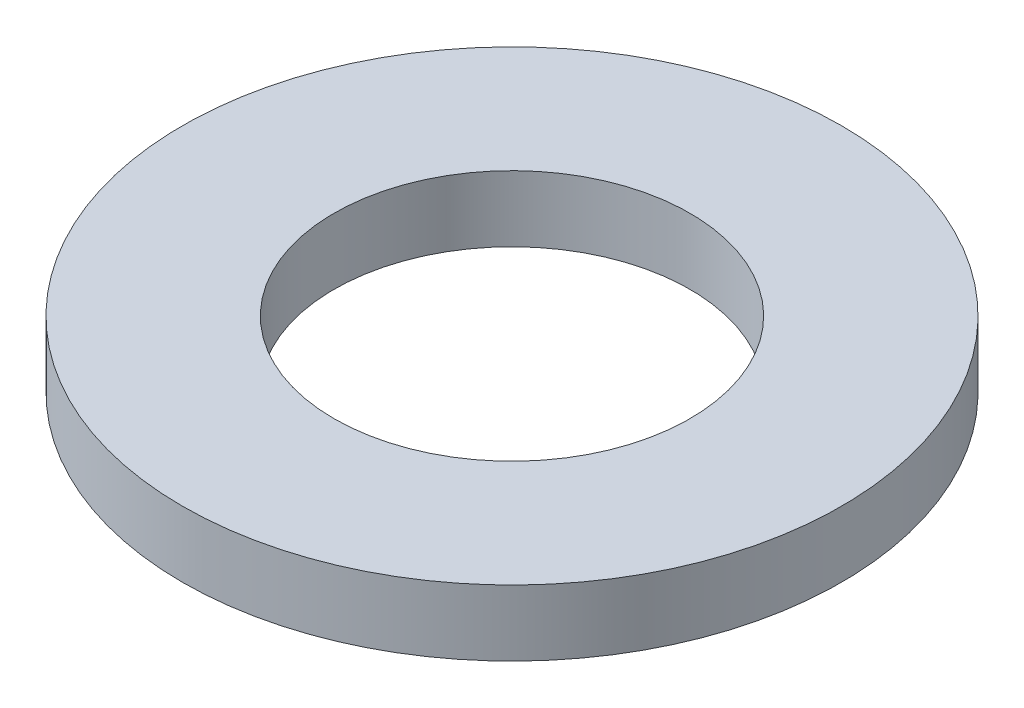
ISO-10303-21;
HEADER;
FILE_DESCRIPTION(('STEP AP214'),'2;1');
FILE_NAME('part.step','',(''),(''),'','','');
FILE_SCHEMA(('AUTOMOTIVE_DESIGN { 1 0 10303 214 1 1 1 1 }'));
ENDSEC;
DATA;
#1=APPLICATION_CONTEXT('core data for automotive mechanical design processes');
#2=APPLICATION_PROTOCOL_DEFINITION('international standard','automotive_design',2000,#1);
#3=PRODUCT_CONTEXT('',#1,'mechanical');
#4=PRODUCT('Part','Part','',(#3));
#5=PRODUCT_RELATED_PRODUCT_CATEGORY('part','',(#4));
#6=PRODUCT_DEFINITION_FORMATION('','',#4);
#7=PRODUCT_DEFINITION_CONTEXT('part definition',#1,'design');
#8=PRODUCT_DEFINITION('design','',#6,#7);
#9=PRODUCT_DEFINITION_SHAPE('','',#8);
#10=(LENGTH_UNIT() NAMED_UNIT(*) SI_UNIT(.MILLI.,.METRE.));
#11=(NAMED_UNIT(*) PLANE_ANGLE_UNIT() SI_UNIT($,.RADIAN.));
#12=(NAMED_UNIT(*) SI_UNIT($,.STERADIAN.) SOLID_ANGLE_UNIT());
#13=UNCERTAINTY_MEASURE_WITH_UNIT(LENGTH_MEASURE(1.E-05),#10,'distance_accuracy_value','');
#14=(GEOMETRIC_REPRESENTATION_CONTEXT(3) GLOBAL_UNCERTAINTY_ASSIGNED_CONTEXT((#13)) GLOBAL_UNIT_ASSIGNED_CONTEXT((#10,
#11,#12)) REPRESENTATION_CONTEXT('',''));
#15=CARTESIAN_POINT('',(0.,0.,0.));
#16=DIRECTION('',(0.,0.,1.));
#17=DIRECTION('',(1.,0.,0.));
#18=AXIS2_PLACEMENT_3D('',#15,#16,#17);
#19=CARTESIAN_POINT('',(0.,1.,0.));
#20=DIRECTION('',(0.,1.,0.));
#21=DIRECTION('',(0.,0.,1.));
#22=AXIS2_PLACEMENT_3D('',#19,#20,#21);
#23=PLANE('',#22);
#24=CARTESIAN_POINT('',(0.,1.,0.));
#25=DIRECTION('',(0.,1.,0.));
#26=DIRECTION('',(0.,0.,1.));
#27=AXIS2_PLACEMENT_3D('',#24,#25,#26);
#28=CIRCLE('',#27,5.);
#29=CARTESIAN_POINT('',(0.,1.,5.));
#30=VERTEX_POINT('',#29);
#31=EDGE_CURVE('E10',#30,#30,#28,.T.);
#32=ORIENTED_EDGE('',*,*,#31,.T.);
#33=EDGE_LOOP('',(#32));
#34=FACE_BOUND('',#33,.T.);
#35=CARTESIAN_POINT('',(0.,1.,0.));
#36=DIRECTION('',(0.,1.,0.));
#37=DIRECTION('',(0.,0.,1.));
#38=AXIS2_PLACEMENT_3D('',#35,#36,#37);
#39=CIRCLE('',#38,2.7);
#40=CARTESIAN_POINT('',(0.,1.,2.7));
#41=VERTEX_POINT('',#40);
#42=EDGE_CURVE('E50',#41,#41,#39,.T.);
#43=ORIENTED_EDGE('',*,*,#42,.F.);
#44=EDGE_LOOP('',(#43));
#45=FACE_BOUND('',#44,.T.);
#46=ADVANCED_FACE('F37',(#34,#45),#23,.T.);
#47=CARTESIAN_POINT('',(0.,0.,0.));
#48=DIRECTION('',(0.,1.,0.));
#49=DIRECTION('',(0.,0.,1.));
#50=AXIS2_PLACEMENT_3D('',#47,#48,#49);
#51=PLANE('',#50);
#52=CARTESIAN_POINT('',(0.,0.,0.));
#53=DIRECTION('',(0.,1.,0.));
#54=DIRECTION('',(0.,0.,1.));
#55=AXIS2_PLACEMENT_3D('',#52,#53,#54);
#56=CIRCLE('',#55,5.);
#57=CARTESIAN_POINT('',(0.,0.,5.));
#58=VERTEX_POINT('',#57);
#59=EDGE_CURVE('E41',#58,#58,#56,.T.);
#60=ORIENTED_EDGE('',*,*,#59,.F.);
#61=EDGE_LOOP('',(#60));
#62=FACE_BOUND('',#61,.T.);
#63=CARTESIAN_POINT('',(0.,0.,0.));
#64=DIRECTION('',(0.,1.,0.));
#65=DIRECTION('',(0.,0.,1.));
#66=AXIS2_PLACEMENT_3D('',#63,#64,#65);
#67=CIRCLE('',#66,2.7);
#68=CARTESIAN_POINT('',(0.,0.,2.7));
#69=VERTEX_POINT('',#68);
#70=EDGE_CURVE('E52',#69,#69,#67,.T.);
#71=ORIENTED_EDGE('',*,*,#70,.T.);
#72=EDGE_LOOP('',(#71));
#73=FACE_BOUND('',#72,.T.);
#74=ADVANCED_FACE('F64',(#62,#73),#51,.F.);
#75=CARTESIAN_POINT('',(0.,1.,0.));
#76=DIRECTION('',(0.,-1.,0.));
#77=DIRECTION('',(0.,0.,-1.));
#78=AXIS2_PLACEMENT_3D('',#75,#76,#77);
#79=CYLINDRICAL_SURFACE('',#78,5.);
#80=ORIENTED_EDGE('',*,*,#31,.F.);
#81=EDGE_LOOP('',(#80));
#82=FACE_BOUND('',#81,.T.);
#83=ORIENTED_EDGE('',*,*,#59,.T.);
#84=EDGE_LOOP('',(#83));
#85=FACE_BOUND('',#84,.T.);
#86=ADVANCED_FACE('F39',(#82,#85),#79,.T.);
#87=CARTESIAN_POINT('',(0.,1.,0.));
#88=DIRECTION('',(0.,-1.,0.));
#89=DIRECTION('',(0.,0.,-1.));
#90=AXIS2_PLACEMENT_3D('',#87,#88,#89);
#91=CYLINDRICAL_SURFACE('',#90,2.7);
#92=ORIENTED_EDGE('',*,*,#42,.T.);
#93=EDGE_LOOP('',(#92));
#94=FACE_BOUND('',#93,.T.);
#95=ORIENTED_EDGE('',*,*,#70,.F.);
#96=EDGE_LOOP('',(#95));
#97=FACE_BOUND('',#96,.T.);
#98=ADVANCED_FACE('F60',(#94,#97),#91,.F.);
#99=CLOSED_SHELL('',(#46,#74,#86,#98));
#100=MANIFOLD_SOLID_BREP('B2',#99);
#101=ADVANCED_BREP_SHAPE_REPRESENTATION('',(#18,#100),#14);
#102=SHAPE_DEFINITION_REPRESENTATION(#9,#101);
ENDSEC;
END-ISO-10303-21;
